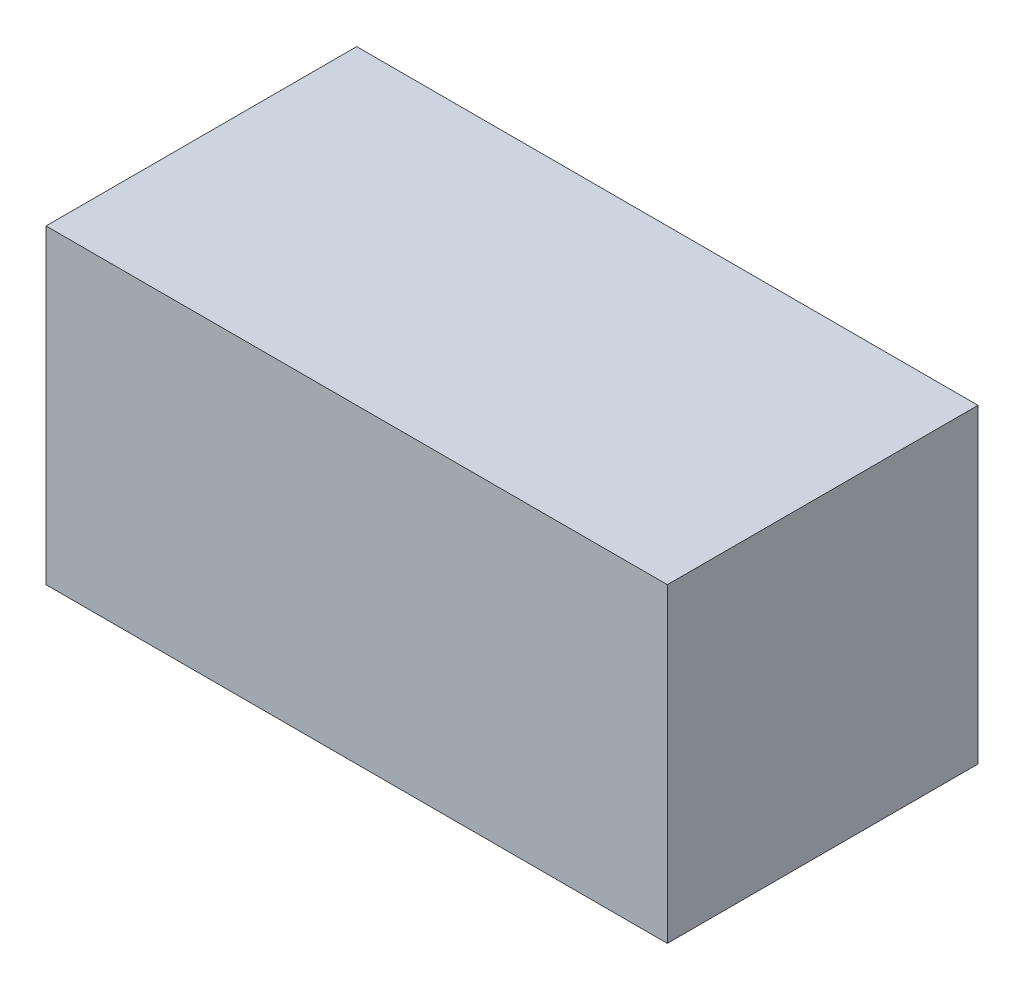
ISO-10303-21;
HEADER;
FILE_DESCRIPTION(('STEP AP214'),'2;1');
FILE_NAME('part.step','',(''),(''),'','','');
FILE_SCHEMA(('AUTOMOTIVE_DESIGN { 1 0 10303 214 1 1 1 1 }'));
ENDSEC;
DATA;
#1=APPLICATION_CONTEXT('core data for automotive mechanical design processes');
#2=APPLICATION_PROTOCOL_DEFINITION('international standard','automotive_design',2000,#1);
#3=PRODUCT_CONTEXT('',#1,'mechanical');
#4=PRODUCT('Part','Part','',(#3));
#5=PRODUCT_RELATED_PRODUCT_CATEGORY('part','',(#4));
#6=PRODUCT_DEFINITION_FORMATION('','',#4);
#7=PRODUCT_DEFINITION_CONTEXT('part definition',#1,'design');
#8=PRODUCT_DEFINITION('design','',#6,#7);
#9=PRODUCT_DEFINITION_SHAPE('','',#8);
#10=(LENGTH_UNIT() NAMED_UNIT(*) SI_UNIT(.MILLI.,.METRE.));
#11=(NAMED_UNIT(*) PLANE_ANGLE_UNIT() SI_UNIT($,.RADIAN.));
#12=(NAMED_UNIT(*) SI_UNIT($,.STERADIAN.) SOLID_ANGLE_UNIT());
#13=UNCERTAINTY_MEASURE_WITH_UNIT(LENGTH_MEASURE(1.E-05),#10,'distance_accuracy_value','');
#14=(GEOMETRIC_REPRESENTATION_CONTEXT(3) GLOBAL_UNCERTAINTY_ASSIGNED_CONTEXT((#13)) GLOBAL_UNIT_ASSIGNED_CONTEXT((#10,
#11,#12)) REPRESENTATION_CONTEXT('',''));
#15=CARTESIAN_POINT('',(0.,0.,0.));
#16=DIRECTION('',(0.,0.,1.));
#17=DIRECTION('',(1.,0.,0.));
#18=AXIS2_PLACEMENT_3D('',#15,#16,#17);
#19=CARTESIAN_POINT('',(250.,250.,125.));
#20=DIRECTION('',(-1.,0.,0.));
#21=DIRECTION('',(0.,0.,1.));
#22=AXIS2_PLACEMENT_3D('',#19,#20,#21);
#23=PLANE('',#22);
#24=DIRECTION('',(0.,0.,-1.));
#25=VECTOR('',#24,1.);
#26=CARTESIAN_POINT('',(250.,0.,125.));
#27=LINE('',#26,#25);
#28=CARTESIAN_POINT('',(250.,0.,125.));
#29=VERTEX_POINT('',#28);
#30=CARTESIAN_POINT('',(250.,0.,-125.));
#31=VERTEX_POINT('',#30);
#32=EDGE_CURVE('E96',#29,#31,#27,.T.);
#33=ORIENTED_EDGE('',*,*,#32,.T.);
#34=DIRECTION('',(0.,-1.,0.));
#35=VECTOR('',#34,1.);
#36=CARTESIAN_POINT('',(250.,250.,-125.));
#37=LINE('',#36,#35);
#38=CARTESIAN_POINT('',(250.,250.,-125.));
#39=VERTEX_POINT('',#38);
#40=EDGE_CURVE('E11',#39,#31,#37,.T.);
#41=ORIENTED_EDGE('',*,*,#40,.F.);
#42=DIRECTION('',(0.,0.,-1.));
#43=VECTOR('',#42,1.);
#44=CARTESIAN_POINT('',(250.,250.,125.));
#45=LINE('',#44,#43);
#46=CARTESIAN_POINT('',(250.,250.,125.));
#47=VERTEX_POINT('',#46);
#48=EDGE_CURVE('E84',#47,#39,#45,.T.);
#49=ORIENTED_EDGE('',*,*,#48,.F.);
#50=DIRECTION('',(0.,-1.,0.));
#51=VECTOR('',#50,1.);
#52=CARTESIAN_POINT('',(250.,250.,125.));
#53=LINE('',#52,#51);
#54=EDGE_CURVE('E92',#47,#29,#53,.T.);
#55=ORIENTED_EDGE('',*,*,#54,.T.);
#56=EDGE_LOOP('',(#33,#41,#49,#55));
#57=FACE_BOUND('',#56,.T.);
#58=ADVANCED_FACE('F33',(#57),#23,.F.);
#59=CARTESIAN_POINT('',(-250.,250.,-125.));
#60=DIRECTION('',(0.,0.,1.));
#61=DIRECTION('',(1.,0.,0.));
#62=AXIS2_PLACEMENT_3D('',#59,#60,#61);
#63=PLANE('',#62);
#64=DIRECTION('',(-1.,0.,0.));
#65=VECTOR('',#64,1.);
#66=CARTESIAN_POINT('',(-250.,0.,-125.));
#67=LINE('',#66,#65);
#68=CARTESIAN_POINT('',(-250.,0.,-125.));
#69=VERTEX_POINT('',#68);
#70=EDGE_CURVE('E88',#31,#69,#67,.T.);
#71=ORIENTED_EDGE('',*,*,#70,.T.);
#72=DIRECTION('',(0.,-1.,0.));
#73=VECTOR('',#72,1.);
#74=CARTESIAN_POINT('',(-250.,250.,-125.));
#75=LINE('',#74,#73);
#76=CARTESIAN_POINT('',(-250.,250.,-125.));
#77=VERTEX_POINT('',#76);
#78=EDGE_CURVE('E41',#77,#69,#75,.T.);
#79=ORIENTED_EDGE('',*,*,#78,.F.);
#80=DIRECTION('',(-1.,0.,0.));
#81=VECTOR('',#80,1.);
#82=CARTESIAN_POINT('',(-250.,250.,-125.));
#83=LINE('',#82,#81);
#84=EDGE_CURVE('E79',#39,#77,#83,.T.);
#85=ORIENTED_EDGE('',*,*,#84,.F.);
#86=ORIENTED_EDGE('',*,*,#40,.T.);
#87=EDGE_LOOP('',(#71,#79,#85,#86));
#88=FACE_BOUND('',#87,.T.);
#89=ADVANCED_FACE('F87',(#88),#63,.F.);
#90=CARTESIAN_POINT('',(-250.,250.,125.));
#91=DIRECTION('',(1.,0.,0.));
#92=DIRECTION('',(0.,0.,-1.));
#93=AXIS2_PLACEMENT_3D('',#90,#91,#92);
#94=PLANE('',#93);
#95=DIRECTION('',(0.,0.,1.));
#96=VECTOR('',#95,1.);
#97=CARTESIAN_POINT('',(-250.,0.,125.));
#98=LINE('',#97,#96);
#99=CARTESIAN_POINT('',(-250.,0.,125.));
#100=VERTEX_POINT('',#99);
#101=EDGE_CURVE('E66',#69,#100,#98,.T.);
#102=ORIENTED_EDGE('',*,*,#101,.T.);
#103=DIRECTION('',(0.,-1.,0.));
#104=VECTOR('',#103,1.);
#105=CARTESIAN_POINT('',(-250.,250.,125.));
#106=LINE('',#105,#104);
#107=CARTESIAN_POINT('',(-250.,250.,125.));
#108=VERTEX_POINT('',#107);
#109=EDGE_CURVE('E89',#108,#100,#106,.T.);
#110=ORIENTED_EDGE('',*,*,#109,.F.);
#111=DIRECTION('',(0.,0.,1.));
#112=VECTOR('',#111,1.);
#113=CARTESIAN_POINT('',(-250.,250.,125.));
#114=LINE('',#113,#112);
#115=EDGE_CURVE('E82',#77,#108,#114,.T.);
#116=ORIENTED_EDGE('',*,*,#115,.F.);
#117=ORIENTED_EDGE('',*,*,#78,.T.);
#118=EDGE_LOOP('',(#102,#110,#116,#117));
#119=FACE_BOUND('',#118,.T.);
#120=ADVANCED_FACE('F90',(#119),#94,.F.);
#121=CARTESIAN_POINT('',(-250.,250.,125.));
#122=DIRECTION('',(0.,0.,-1.));
#123=DIRECTION('',(-1.,0.,0.));
#124=AXIS2_PLACEMENT_3D('',#121,#122,#123);
#125=PLANE('',#124);
#126=DIRECTION('',(1.,0.,0.));
#127=VECTOR('',#126,1.);
#128=CARTESIAN_POINT('',(-250.,0.,125.));
#129=LINE('',#128,#127);
#130=EDGE_CURVE('E72',#100,#29,#129,.T.);
#131=ORIENTED_EDGE('',*,*,#130,.T.);
#132=ORIENTED_EDGE('',*,*,#54,.F.);
#133=DIRECTION('',(1.,0.,0.));
#134=VECTOR('',#133,1.);
#135=CARTESIAN_POINT('',(-250.,250.,125.));
#136=LINE('',#135,#134);
#137=EDGE_CURVE('E49',#108,#47,#136,.T.);
#138=ORIENTED_EDGE('',*,*,#137,.F.);
#139=ORIENTED_EDGE('',*,*,#109,.T.);
#140=EDGE_LOOP('',(#131,#132,#138,#139));
#141=FACE_BOUND('',#140,.T.);
#142=ADVANCED_FACE('F103',(#141),#125,.F.);
#143=CARTESIAN_POINT('',(0.,250.,0.));
#144=DIRECTION('',(0.,-1.,0.));
#145=DIRECTION('',(0.,0.,-1.));
#146=AXIS2_PLACEMENT_3D('',#143,#144,#145);
#147=PLANE('',#146);
#148=ORIENTED_EDGE('',*,*,#48,.T.);
#149=ORIENTED_EDGE('',*,*,#84,.T.);
#150=ORIENTED_EDGE('',*,*,#115,.T.);
#151=ORIENTED_EDGE('',*,*,#137,.T.);
#152=EDGE_LOOP('',(#148,#149,#150,#151));
#153=FACE_BOUND('',#152,.T.);
#154=ADVANCED_FACE('F80',(#153),#147,.F.);
#155=CARTESIAN_POINT('',(0.,0.,0.));
#156=DIRECTION('',(0.,-1.,0.));
#157=DIRECTION('',(0.,0.,-1.));
#158=AXIS2_PLACEMENT_3D('',#155,#156,#157);
#159=PLANE('',#158);
#160=ORIENTED_EDGE('',*,*,#32,.F.);
#161=ORIENTED_EDGE('',*,*,#130,.F.);
#162=ORIENTED_EDGE('',*,*,#101,.F.);
#163=ORIENTED_EDGE('',*,*,#70,.F.);
#164=EDGE_LOOP('',(#160,#161,#162,#163));
#165=FACE_BOUND('',#164,.T.);
#166=ADVANCED_FACE('F106',(#165),#159,.T.);
#167=CLOSED_SHELL('',(#58,#89,#120,#142,#154,#166));
#168=MANIFOLD_SOLID_BREP('B2',#167);
#169=ADVANCED_BREP_SHAPE_REPRESENTATION('',(#18,#168),#14);
#170=SHAPE_DEFINITION_REPRESENTATION(#9,#169);
ENDSEC;
END-ISO-10303-21;
